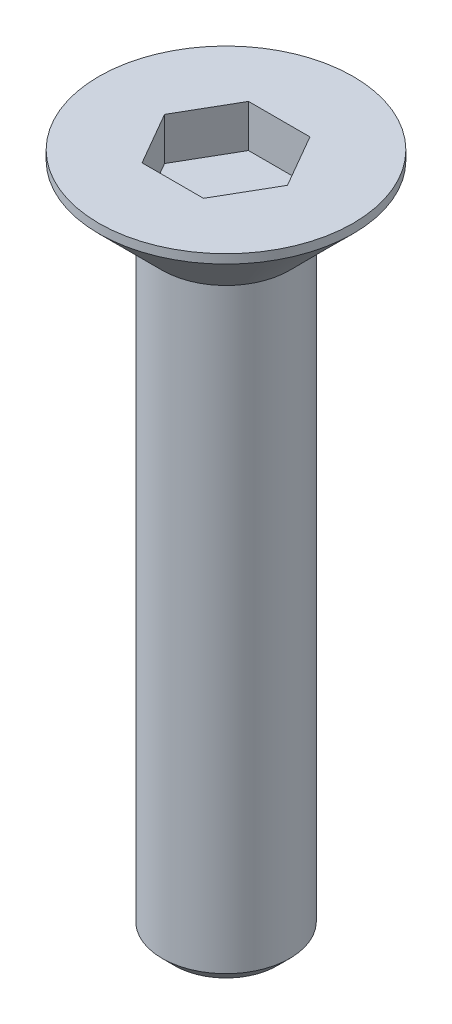
ISO-10303-21;
HEADER;
FILE_DESCRIPTION(('STEP AP214'),'2;1');
FILE_NAME('part.step','',(''),(''),'','','');
FILE_SCHEMA(('AUTOMOTIVE_DESIGN { 1 0 10303 214 1 1 1 1 }'));
ENDSEC;
DATA;
#1=APPLICATION_CONTEXT('core data for automotive mechanical design processes');
#2=APPLICATION_PROTOCOL_DEFINITION('international standard','automotive_design',2000,#1);
#3=PRODUCT_CONTEXT('',#1,'mechanical');
#4=PRODUCT('Part','Part','',(#3));
#5=PRODUCT_RELATED_PRODUCT_CATEGORY('part','',(#4));
#6=PRODUCT_DEFINITION_FORMATION('','',#4);
#7=PRODUCT_DEFINITION_CONTEXT('part definition',#1,'design');
#8=PRODUCT_DEFINITION('design','',#6,#7);
#9=PRODUCT_DEFINITION_SHAPE('','',#8);
#10=(LENGTH_UNIT() NAMED_UNIT(*) SI_UNIT(.MILLI.,.METRE.));
#11=(NAMED_UNIT(*) PLANE_ANGLE_UNIT() SI_UNIT($,.RADIAN.));
#12=(NAMED_UNIT(*) SI_UNIT($,.STERADIAN.) SOLID_ANGLE_UNIT());
#13=UNCERTAINTY_MEASURE_WITH_UNIT(LENGTH_MEASURE(1.E-05),#10,'distance_accuracy_value','');
#14=(GEOMETRIC_REPRESENTATION_CONTEXT(3) GLOBAL_UNCERTAINTY_ASSIGNED_CONTEXT((#13)) GLOBAL_UNIT_ASSIGNED_CONTEXT((#10,
#11,#12)) REPRESENTATION_CONTEXT('',''));
#15=CARTESIAN_POINT('',(0.,0.,0.));
#16=DIRECTION('',(0.,0.,1.));
#17=DIRECTION('',(1.,0.,0.));
#18=AXIS2_PLACEMENT_3D('',#15,#16,#17);
#19=CARTESIAN_POINT('',(0.,0.,0.));
#20=DIRECTION('',(0.,-1.,0.));
#21=DIRECTION('',(0.,0.,-1.));
#22=AXIS2_PLACEMENT_3D('',#19,#20,#21);
#23=PLANE('',#22);
#24=DIRECTION('',(-0.5,0.,0.866025403784439));
#25=VECTOR('',#24,1.);
#26=CARTESIAN_POINT('',(-0.721687836487032,0.,-1.25));
#27=LINE('',#26,#25);
#28=CARTESIAN_POINT('',(-0.721687836487032,0.,-1.25));
#29=VERTEX_POINT('',#28);
#30=CARTESIAN_POINT('',(-1.44337567297406,0.,0.));
#31=VERTEX_POINT('',#30);
#32=EDGE_CURVE('E147',#29,#31,#27,.T.);
#33=ORIENTED_EDGE('',*,*,#32,.F.);
#34=DIRECTION('',(-1.,0.,0.));
#35=VECTOR('',#34,1.);
#36=CARTESIAN_POINT('',(0.721687836487033,0.,-1.25));
#37=LINE('',#36,#35);
#38=CARTESIAN_POINT('',(0.721687836487033,0.,-1.25));
#39=VERTEX_POINT('',#38);
#40=EDGE_CURVE('E57',#39,#29,#37,.T.);
#41=ORIENTED_EDGE('',*,*,#40,.F.);
#42=DIRECTION('',(-0.5,0.,-0.866025403784439));
#43=VECTOR('',#42,1.);
#44=CARTESIAN_POINT('',(1.44337567297406,0.,0.));
#45=LINE('',#44,#43);
#46=CARTESIAN_POINT('',(1.44337567297406,0.,0.));
#47=VERTEX_POINT('',#46);
#48=EDGE_CURVE('E160',#47,#39,#45,.T.);
#49=ORIENTED_EDGE('',*,*,#48,.F.);
#50=DIRECTION('',(0.5,0.,-0.866025403784438));
#51=VECTOR('',#50,1.);
#52=CARTESIAN_POINT('',(0.721687836487032,0.,1.25));
#53=LINE('',#52,#51);
#54=CARTESIAN_POINT('',(0.721687836487032,0.,1.25));
#55=VERTEX_POINT('',#54);
#56=EDGE_CURVE('E157',#55,#47,#53,.T.);
#57=ORIENTED_EDGE('',*,*,#56,.F.);
#58=DIRECTION('',(1.,0.,0.));
#59=VECTOR('',#58,1.);
#60=CARTESIAN_POINT('',(-0.721687836487033,0.,1.25));
#61=LINE('',#60,#59);
#62=CARTESIAN_POINT('',(-0.721687836487033,0.,1.25));
#63=VERTEX_POINT('',#62);
#64=EDGE_CURVE('E115',#63,#55,#61,.T.);
#65=ORIENTED_EDGE('',*,*,#64,.F.);
#66=DIRECTION('',(0.5,0.,0.866025403784439));
#67=VECTOR('',#66,1.);
#68=CARTESIAN_POINT('',(-1.44337567297406,0.,0.));
#69=LINE('',#68,#67);
#70=EDGE_CURVE('E151',#31,#63,#69,.T.);
#71=ORIENTED_EDGE('',*,*,#70,.F.);
#72=EDGE_LOOP('',(#33,#41,#49,#57,#65,#71));
#73=FACE_BOUND('',#72,.T.);
#74=CARTESIAN_POINT('',(0.,0.,0.));
#75=DIRECTION('',(0.,-1.,0.));
#76=DIRECTION('',(0.,0.,-1.));
#77=AXIS2_PLACEMENT_3D('',#74,#75,#76);
#78=CIRCLE('',#77,2.98786796564402);
#79=CARTESIAN_POINT('',(0.,0.,-2.98786796564402));
#80=VERTEX_POINT('',#79);
#81=EDGE_CURVE('E179',#80,#80,#78,.F.);
#82=ORIENTED_EDGE('',*,*,#81,.T.);
#83=EDGE_LOOP('',(#82));
#84=FACE_BOUND('',#83,.T.);
#85=ADVANCED_FACE('F40',(#73,#84),#23,.F.);
#86=CARTESIAN_POINT('',(0.,-1.7,0.));
#87=DIRECTION('',(0.,1.,0.));
#88=DIRECTION('',(0.,0.,1.));
#89=AXIS2_PLACEMENT_3D('',#86,#87,#88);
#90=CONICAL_SURFACE('',#89,1.5,0.785398163397443);
#91=CARTESIAN_POINT('',(0.,-0.212132034355965,0.));
#92=DIRECTION('',(0.,-1.,0.));
#93=DIRECTION('',(0.,0.,-1.));
#94=AXIS2_PLACEMENT_3D('',#91,#92,#93);
#95=CIRCLE('',#94,2.98786796564402);
#96=CARTESIAN_POINT('',(0.,-0.212132034355965,-2.98786796564402));
#97=VERTEX_POINT('',#96);
#98=EDGE_CURVE('E183',#97,#97,#95,.T.);
#99=ORIENTED_EDGE('',*,*,#98,.T.);
#100=EDGE_LOOP('',(#99));
#101=FACE_BOUND('',#100,.T.);
#102=CARTESIAN_POINT('',(0.,-1.7,0.));
#103=DIRECTION('',(0.,1.,0.));
#104=DIRECTION('',(0.,0.,1.));
#105=AXIS2_PLACEMENT_3D('',#102,#103,#104);
#106=CIRCLE('',#105,1.5);
#107=CARTESIAN_POINT('',(0.,-1.7,1.5));
#108=VERTEX_POINT('',#107);
#109=EDGE_CURVE('E166',#108,#108,#106,.T.);
#110=ORIENTED_EDGE('',*,*,#109,.T.);
#111=EDGE_LOOP('',(#110));
#112=FACE_BOUND('',#111,.T.);
#113=ADVANCED_FACE('F206',(#101,#112),#90,.T.);
#114=CARTESIAN_POINT('',(0.,0.,0.));
#115=DIRECTION('',(0.,1.,0.));
#116=DIRECTION('',(0.,0.,1.));
#117=AXIS2_PLACEMENT_3D('',#114,#115,#116);
#118=CYLINDRICAL_SURFACE('',#117,1.5);
#119=CARTESIAN_POINT('',(0.,-15.7,0.));
#120=DIRECTION('',(0.,1.,0.));
#121=DIRECTION('',(0.,0.,1.));
#122=AXIS2_PLACEMENT_3D('',#119,#120,#121);
#123=CIRCLE('',#122,1.5);
#124=CARTESIAN_POINT('',(0.,-15.7,1.5));
#125=VERTEX_POINT('',#124);
#126=EDGE_CURVE('E48',#125,#125,#123,.T.);
#127=ORIENTED_EDGE('',*,*,#126,.T.);
#128=EDGE_LOOP('',(#127));
#129=FACE_BOUND('',#128,.T.);
#130=ORIENTED_EDGE('',*,*,#109,.F.);
#131=EDGE_LOOP('',(#130));
#132=FACE_BOUND('',#131,.T.);
#133=ADVANCED_FACE('F189',(#129,#132),#118,.T.);
#134=CARTESIAN_POINT('',(1.5,-16.,0.));
#135=DIRECTION('',(0.,1.,0.));
#136=DIRECTION('',(0.,0.,1.));
#137=AXIS2_PLACEMENT_3D('',#134,#135,#136);
#138=PLANE('',#137);
#139=CARTESIAN_POINT('',(0.,-16.,0.));
#140=DIRECTION('',(0.,1.,0.));
#141=DIRECTION('',(0.,0.,1.));
#142=AXIS2_PLACEMENT_3D('',#139,#140,#141);
#143=CIRCLE('',#142,1.2);
#144=CARTESIAN_POINT('',(0.,-16.,1.2));
#145=VERTEX_POINT('',#144);
#146=EDGE_CURVE('E11',#145,#145,#143,.F.);
#147=ORIENTED_EDGE('',*,*,#146,.T.);
#148=EDGE_LOOP('',(#147));
#149=FACE_BOUND('',#148,.T.);
#150=ADVANCED_FACE('F202',(#149),#138,.F.);
#151=CARTESIAN_POINT('',(0.,0.,0.));
#152=DIRECTION('',(0.,-1.,0.));
#153=DIRECTION('',(0.,0.,-1.));
#154=AXIS2_PLACEMENT_3D('',#151,#152,#153);
#155=CYLINDRICAL_SURFACE('',#154,2.98786796564402);
#156=ORIENTED_EDGE('',*,*,#98,.F.);
#157=EDGE_LOOP('',(#156));
#158=FACE_BOUND('',#157,.T.);
#159=ORIENTED_EDGE('',*,*,#81,.F.);
#160=EDGE_LOOP('',(#159));
#161=FACE_BOUND('',#160,.T.);
#162=ADVANCED_FACE('F194',(#158,#161),#155,.T.);
#163=CARTESIAN_POINT('',(0.,-15.7,0.));
#164=DIRECTION('',(0.,1.,0.));
#165=DIRECTION('',(0.,0.,1.));
#166=AXIS2_PLACEMENT_3D('',#163,#164,#165);
#167=CONICAL_SURFACE('',#166,1.5,0.785398163397448);
#168=ORIENTED_EDGE('',*,*,#146,.F.);
#169=EDGE_LOOP('',(#168));
#170=FACE_BOUND('',#169,.T.);
#171=ORIENTED_EDGE('',*,*,#126,.F.);
#172=EDGE_LOOP('',(#171));
#173=FACE_BOUND('',#172,.T.);
#174=ADVANCED_FACE('F42',(#170,#173),#167,.T.);
#175=CARTESIAN_POINT('',(0.721687836487033,-1.,-1.25));
#176=DIRECTION('',(0.,0.,-1.));
#177=DIRECTION('',(-1.,0.,0.));
#178=AXIS2_PLACEMENT_3D('',#175,#176,#177);
#179=PLANE('',#178);
#180=ORIENTED_EDGE('',*,*,#40,.T.);
#181=DIRECTION('',(0.,1.,0.));
#182=VECTOR('',#181,1.);
#183=CARTESIAN_POINT('',(-0.721687836487032,-1.,-1.25));
#184=LINE('',#183,#182);
#185=CARTESIAN_POINT('',(-0.721687836487032,-1.,-1.25));
#186=VERTEX_POINT('',#185);
#187=EDGE_CURVE('E95',#186,#29,#184,.T.);
#188=ORIENTED_EDGE('',*,*,#187,.F.);
#189=DIRECTION('',(-1.,0.,0.));
#190=VECTOR('',#189,1.);
#191=CARTESIAN_POINT('',(0.721687836487033,-1.,-1.25));
#192=LINE('',#191,#190);
#193=CARTESIAN_POINT('',(0.721687836487033,-1.,-1.25));
#194=VERTEX_POINT('',#193);
#195=EDGE_CURVE('E163',#194,#186,#192,.T.);
#196=ORIENTED_EDGE('',*,*,#195,.F.);
#197=DIRECTION('',(0.,1.,0.));
#198=VECTOR('',#197,1.);
#199=CARTESIAN_POINT('',(0.721687836487033,-1.,-1.25));
#200=LINE('',#199,#198);
#201=EDGE_CURVE('E68',#194,#39,#200,.T.);
#202=ORIENTED_EDGE('',*,*,#201,.T.);
#203=EDGE_LOOP('',(#180,#188,#196,#202));
#204=FACE_BOUND('',#203,.T.);
#205=ADVANCED_FACE('F193',(#204),#179,.F.);
#206=CARTESIAN_POINT('',(1.44337567297406,-1.,0.));
#207=DIRECTION('',(0.866025403784439,0.,-0.5));
#208=DIRECTION('',(-0.5,0.,-0.866025403784439));
#209=AXIS2_PLACEMENT_3D('',#206,#207,#208);
#210=PLANE('',#209);
#211=ORIENTED_EDGE('',*,*,#48,.T.);
#212=ORIENTED_EDGE('',*,*,#201,.F.);
#213=DIRECTION('',(-0.5,0.,-0.866025403784439));
#214=VECTOR('',#213,1.);
#215=CARTESIAN_POINT('',(1.44337567297406,-1.,0.));
#216=LINE('',#215,#214);
#217=CARTESIAN_POINT('',(1.44337567297406,-1.,0.));
#218=VERTEX_POINT('',#217);
#219=EDGE_CURVE('E129',#218,#194,#216,.T.);
#220=ORIENTED_EDGE('',*,*,#219,.F.);
#221=DIRECTION('',(0.,1.,0.));
#222=VECTOR('',#221,1.);
#223=CARTESIAN_POINT('',(1.44337567297406,-1.,0.));
#224=LINE('',#223,#222);
#225=EDGE_CURVE('E120',#218,#47,#224,.T.);
#226=ORIENTED_EDGE('',*,*,#225,.T.);
#227=EDGE_LOOP('',(#211,#212,#220,#226));
#228=FACE_BOUND('',#227,.T.);
#229=ADVANCED_FACE('F200',(#228),#210,.F.);
#230=CARTESIAN_POINT('',(0.721687836487032,-1.,1.25));
#231=DIRECTION('',(0.866025403784439,0.,0.5));
#232=DIRECTION('',(0.5,0.,-0.866025403784438));
#233=AXIS2_PLACEMENT_3D('',#230,#231,#232);
#234=PLANE('',#233);
#235=ORIENTED_EDGE('',*,*,#56,.T.);
#236=ORIENTED_EDGE('',*,*,#225,.F.);
#237=DIRECTION('',(0.5,0.,-0.866025403784438));
#238=VECTOR('',#237,1.);
#239=CARTESIAN_POINT('',(0.721687836487032,-1.,1.25));
#240=LINE('',#239,#238);
#241=CARTESIAN_POINT('',(0.721687836487032,-1.,1.25));
#242=VERTEX_POINT('',#241);
#243=EDGE_CURVE('E124',#242,#218,#240,.T.);
#244=ORIENTED_EDGE('',*,*,#243,.F.);
#245=DIRECTION('',(0.,1.,0.));
#246=VECTOR('',#245,1.);
#247=CARTESIAN_POINT('',(0.721687836487032,-1.,1.25));
#248=LINE('',#247,#246);
#249=EDGE_CURVE('E108',#242,#55,#248,.T.);
#250=ORIENTED_EDGE('',*,*,#249,.T.);
#251=EDGE_LOOP('',(#235,#236,#244,#250));
#252=FACE_BOUND('',#251,.T.);
#253=ADVANCED_FACE('F125',(#252),#234,.F.);
#254=CARTESIAN_POINT('',(-0.721687836487033,-1.,1.25));
#255=DIRECTION('',(0.,0.,1.));
#256=DIRECTION('',(1.,0.,0.));
#257=AXIS2_PLACEMENT_3D('',#254,#255,#256);
#258=PLANE('',#257);
#259=ORIENTED_EDGE('',*,*,#64,.T.);
#260=ORIENTED_EDGE('',*,*,#249,.F.);
#261=DIRECTION('',(1.,0.,0.));
#262=VECTOR('',#261,1.);
#263=CARTESIAN_POINT('',(-0.721687836487033,-1.,1.25));
#264=LINE('',#263,#262);
#265=CARTESIAN_POINT('',(-0.721687836487033,-1.,1.25));
#266=VERTEX_POINT('',#265);
#267=EDGE_CURVE('E112',#266,#242,#264,.T.);
#268=ORIENTED_EDGE('',*,*,#267,.F.);
#269=DIRECTION('',(0.,1.,0.));
#270=VECTOR('',#269,1.);
#271=CARTESIAN_POINT('',(-0.721687836487033,-1.,1.25));
#272=LINE('',#271,#270);
#273=EDGE_CURVE('E121',#266,#63,#272,.T.);
#274=ORIENTED_EDGE('',*,*,#273,.T.);
#275=EDGE_LOOP('',(#259,#260,#268,#274));
#276=FACE_BOUND('',#275,.T.);
#277=ADVANCED_FACE('F110',(#276),#258,.F.);
#278=CARTESIAN_POINT('',(-1.44337567297406,-1.,0.));
#279=DIRECTION('',(-0.866025403784439,0.,0.5));
#280=DIRECTION('',(0.5,0.,0.866025403784439));
#281=AXIS2_PLACEMENT_3D('',#278,#279,#280);
#282=PLANE('',#281);
#283=ORIENTED_EDGE('',*,*,#70,.T.);
#284=ORIENTED_EDGE('',*,*,#273,.F.);
#285=DIRECTION('',(0.5,0.,0.866025403784439));
#286=VECTOR('',#285,1.);
#287=CARTESIAN_POINT('',(-1.44337567297406,-1.,0.));
#288=LINE('',#287,#286);
#289=CARTESIAN_POINT('',(-1.44337567297406,-1.,0.));
#290=VERTEX_POINT('',#289);
#291=EDGE_CURVE('E135',#290,#266,#288,.T.);
#292=ORIENTED_EDGE('',*,*,#291,.F.);
#293=DIRECTION('',(0.,1.,0.));
#294=VECTOR('',#293,1.);
#295=CARTESIAN_POINT('',(-1.44337567297406,-1.,0.));
#296=LINE('',#295,#294);
#297=EDGE_CURVE('E171',#290,#31,#296,.T.);
#298=ORIENTED_EDGE('',*,*,#297,.T.);
#299=EDGE_LOOP('',(#283,#284,#292,#298));
#300=FACE_BOUND('',#299,.T.);
#301=ADVANCED_FACE('F225',(#300),#282,.F.);
#302=CARTESIAN_POINT('',(-0.721687836487032,-1.,-1.25));
#303=DIRECTION('',(-0.866025403784439,0.,-0.5));
#304=DIRECTION('',(-0.5,0.,0.866025403784439));
#305=AXIS2_PLACEMENT_3D('',#302,#303,#304);
#306=PLANE('',#305);
#307=ORIENTED_EDGE('',*,*,#32,.T.);
#308=ORIENTED_EDGE('',*,*,#297,.F.);
#309=DIRECTION('',(-0.5,0.,0.866025403784439));
#310=VECTOR('',#309,1.);
#311=CARTESIAN_POINT('',(-0.721687836487032,-1.,-1.25));
#312=LINE('',#311,#310);
#313=EDGE_CURVE('E139',#186,#290,#312,.T.);
#314=ORIENTED_EDGE('',*,*,#313,.F.);
#315=ORIENTED_EDGE('',*,*,#187,.T.);
#316=EDGE_LOOP('',(#307,#308,#314,#315));
#317=FACE_BOUND('',#316,.T.);
#318=ADVANCED_FACE('F222',(#317),#306,.F.);
#319=CARTESIAN_POINT('',(-0.721687836487032,-1.,-1.25));
#320=DIRECTION('',(0.,1.,0.));
#321=DIRECTION('',(0.,0.,1.));
#322=AXIS2_PLACEMENT_3D('',#319,#320,#321);
#323=PLANE('',#322);
#324=ORIENTED_EDGE('',*,*,#195,.T.);
#325=ORIENTED_EDGE('',*,*,#313,.T.);
#326=ORIENTED_EDGE('',*,*,#291,.T.);
#327=ORIENTED_EDGE('',*,*,#267,.T.);
#328=ORIENTED_EDGE('',*,*,#243,.T.);
#329=ORIENTED_EDGE('',*,*,#219,.T.);
#330=EDGE_LOOP('',(#324,#325,#326,#327,#328,#329));
#331=FACE_BOUND('',#330,.T.);
#332=ADVANCED_FACE('F132',(#331),#323,.T.);
#333=CLOSED_SHELL('',(#85,#113,#133,#150,#162,#174,#205,#229,#253,#277,#301,#318,#332));
#334=MANIFOLD_SOLID_BREP('B2',#333);
#335=ADVANCED_BREP_SHAPE_REPRESENTATION('',(#18,#334),#14);
#336=SHAPE_DEFINITION_REPRESENTATION(#9,#335);
ENDSEC;
END-ISO-10303-21;
